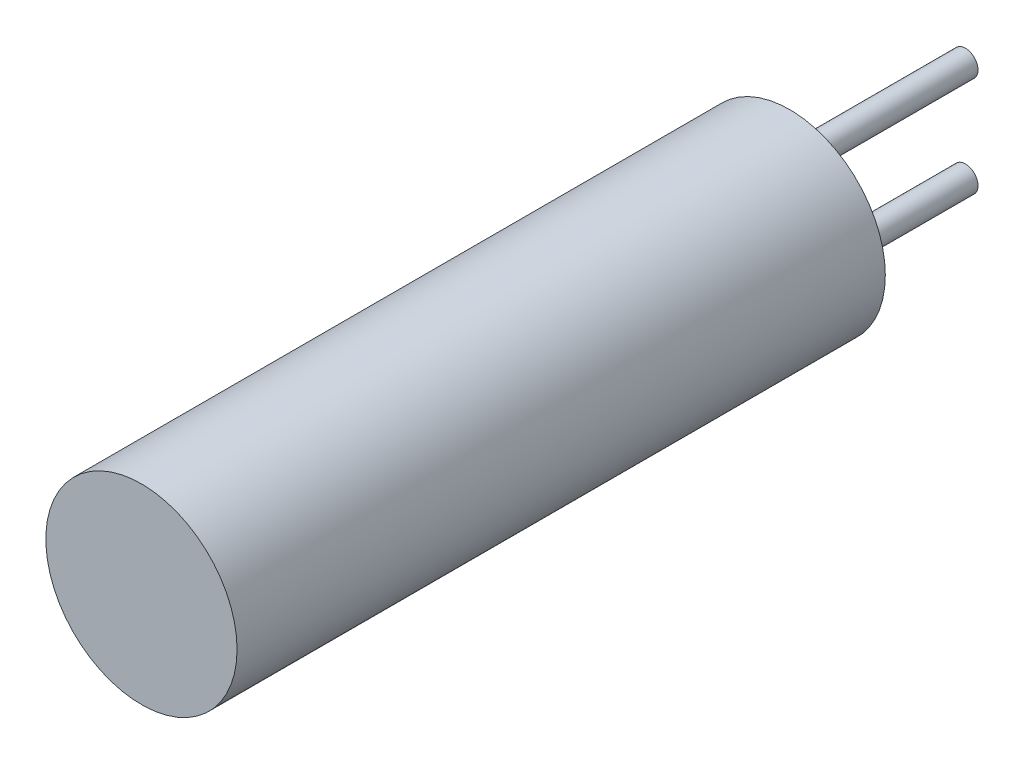
ISO-10303-21;
HEADER;
FILE_DESCRIPTION(('STEP AP214'),'2;1');
FILE_NAME('part.step','',(''),(''),'','','');
FILE_SCHEMA(('AUTOMOTIVE_DESIGN { 1 0 10303 214 1 1 1 1 }'));
ENDSEC;
DATA;
#1=APPLICATION_CONTEXT('core data for automotive mechanical design processes');
#2=APPLICATION_PROTOCOL_DEFINITION('international standard','automotive_design',2000,#1);
#3=PRODUCT_CONTEXT('',#1,'mechanical');
#4=PRODUCT('Part','Part','',(#3));
#5=PRODUCT_RELATED_PRODUCT_CATEGORY('part','',(#4));
#6=PRODUCT_DEFINITION_FORMATION('','',#4);
#7=PRODUCT_DEFINITION_CONTEXT('part definition',#1,'design');
#8=PRODUCT_DEFINITION('design','',#6,#7);
#9=PRODUCT_DEFINITION_SHAPE('','',#8);
#10=(LENGTH_UNIT() NAMED_UNIT(*) SI_UNIT(.MILLI.,.METRE.));
#11=(NAMED_UNIT(*) PLANE_ANGLE_UNIT() SI_UNIT($,.RADIAN.));
#12=(NAMED_UNIT(*) SI_UNIT($,.STERADIAN.) SOLID_ANGLE_UNIT());
#13=UNCERTAINTY_MEASURE_WITH_UNIT(LENGTH_MEASURE(1.E-05),#10,'distance_accuracy_value','');
#14=(GEOMETRIC_REPRESENTATION_CONTEXT(3) GLOBAL_UNCERTAINTY_ASSIGNED_CONTEXT((#13)) GLOBAL_UNIT_ASSIGNED_CONTEXT((#10,
#11,#12)) REPRESENTATION_CONTEXT('',''));
#15=CARTESIAN_POINT('',(0.,0.,0.));
#16=DIRECTION('',(0.,0.,1.));
#17=DIRECTION('',(1.,0.,0.));
#18=AXIS2_PLACEMENT_3D('',#15,#16,#17);
#19=CARTESIAN_POINT('',(0.,0.,-5.42));
#20=DIRECTION('',(0.,0.,-1.));
#21=DIRECTION('',(-1.,0.,0.));
#22=AXIS2_PLACEMENT_3D('',#19,#20,#21);
#23=PLANE('',#22);
#24=CARTESIAN_POINT('',(0.,1.489822979376,-5.42));
#25=DIRECTION('',(0.,0.,-1.));
#26=DIRECTION('',(-1.,0.,0.));
#27=AXIS2_PLACEMENT_3D('',#24,#25,#26);
#28=CIRCLE('',#27,0.3898185985847);
#29=CARTESIAN_POINT('',(-0.3898185985847,1.489822979376,-5.42));
#30=VERTEX_POINT('',#29);
#31=EDGE_CURVE('E17',#30,#30,#28,.F.);
#32=ORIENTED_EDGE('',*,*,#31,.F.);
#33=EDGE_LOOP('',(#32));
#34=FACE_BOUND('',#33,.T.);
#35=ADVANCED_FACE('F14',(#34),#23,.T.);
#36=CARTESIAN_POINT('',(0.,0.,-5.42));
#37=DIRECTION('',(0.,0.,-1.));
#38=DIRECTION('',(-1.,0.,0.));
#39=AXIS2_PLACEMENT_3D('',#36,#37,#38);
#40=PLANE('',#39);
#41=CARTESIAN_POINT('',(0.,-1.602262449517,-5.42));
#42=DIRECTION('',(0.,0.,-1.));
#43=DIRECTION('',(-1.,0.,0.));
#44=AXIS2_PLACEMENT_3D('',#41,#42,#43);
#45=CIRCLE('',#44,0.3898185985847);
#46=CARTESIAN_POINT('',(-0.3898185985847,-1.602262449517,-5.42));
#47=VERTEX_POINT('',#46);
#48=EDGE_CURVE('E33',#47,#47,#45,.F.);
#49=ORIENTED_EDGE('',*,*,#48,.F.);
#50=EDGE_LOOP('',(#49));
#51=FACE_BOUND('',#50,.T.);
#52=ADVANCED_FACE('F44',(#51),#40,.T.);
#53=CARTESIAN_POINT('',(0.,1.489822979376,0.));
#54=DIRECTION('',(0.,0.,-1.));
#55=DIRECTION('',(-1.,0.,0.));
#56=AXIS2_PLACEMENT_3D('',#53,#54,#55);
#57=CYLINDRICAL_SURFACE('',#56,0.3898185985847);
#58=ORIENTED_EDGE('',*,*,#31,.T.);
#59=EDGE_LOOP('',(#58));
#60=FACE_BOUND('',#59,.T.);
#61=CARTESIAN_POINT('',(0.,1.489822979376,0.));
#62=DIRECTION('',(0.,0.,-1.));
#63=DIRECTION('',(-1.,0.,0.));
#64=AXIS2_PLACEMENT_3D('',#61,#62,#63);
#65=CIRCLE('',#64,0.3898185985847);
#66=CARTESIAN_POINT('',(-0.3898185985847,1.489822979376,0.));
#67=VERTEX_POINT('',#66);
#68=EDGE_CURVE('E31',#67,#67,#65,.T.);
#69=ORIENTED_EDGE('',*,*,#68,.T.);
#70=EDGE_LOOP('',(#69));
#71=FACE_BOUND('',#70,.T.);
#72=ADVANCED_FACE('F40',(#60,#71),#57,.T.);
#73=CARTESIAN_POINT('',(0.,-1.602262449517,0.));
#74=DIRECTION('',(0.,0.,-1.));
#75=DIRECTION('',(-1.,0.,0.));
#76=AXIS2_PLACEMENT_3D('',#73,#74,#75);
#77=CYLINDRICAL_SURFACE('',#76,0.3898185985847);
#78=ORIENTED_EDGE('',*,*,#48,.T.);
#79=EDGE_LOOP('',(#78));
#80=FACE_BOUND('',#79,.T.);
#81=CARTESIAN_POINT('',(0.,-1.602262449517,0.));
#82=DIRECTION('',(0.,0.,-1.));
#83=DIRECTION('',(-1.,0.,0.));
#84=AXIS2_PLACEMENT_3D('',#81,#82,#83);
#85=CIRCLE('',#84,0.3898185985847);
#86=CARTESIAN_POINT('',(-0.3898185985847,-1.602262449517,0.));
#87=VERTEX_POINT('',#86);
#88=EDGE_CURVE('E26',#87,#87,#85,.T.);
#89=ORIENTED_EDGE('',*,*,#88,.T.);
#90=EDGE_LOOP('',(#89));
#91=FACE_BOUND('',#90,.T.);
#92=ADVANCED_FACE('F64',(#80,#91),#77,.T.);
#93=CARTESIAN_POINT('',(0.,0.,20.));
#94=DIRECTION('',(0.,0.,1.));
#95=DIRECTION('',(1.,0.,0.));
#96=AXIS2_PLACEMENT_3D('',#93,#94,#95);
#97=PLANE('',#96);
#98=CARTESIAN_POINT('',(0.,0.,20.));
#99=DIRECTION('',(0.,0.,1.));
#100=DIRECTION('',(1.,0.,0.));
#101=AXIS2_PLACEMENT_3D('',#98,#99,#100);
#102=CIRCLE('',#101,2.95);
#103=CARTESIAN_POINT('',(2.95,0.,20.));
#104=VERTEX_POINT('',#103);
#105=EDGE_CURVE('E21',#104,#104,#102,.F.);
#106=ORIENTED_EDGE('',*,*,#105,.F.);
#107=EDGE_LOOP('',(#106));
#108=FACE_BOUND('',#107,.T.);
#109=ADVANCED_FACE('F58',(#108),#97,.T.);
#110=CARTESIAN_POINT('',(0.,0.,0.));
#111=DIRECTION('',(0.,0.,1.));
#112=DIRECTION('',(1.,0.,0.));
#113=AXIS2_PLACEMENT_3D('',#110,#111,#112);
#114=PLANE('',#113);
#115=ORIENTED_EDGE('',*,*,#88,.F.);
#116=EDGE_LOOP('',(#115));
#117=FACE_BOUND('',#116,.T.);
#118=ORIENTED_EDGE('',*,*,#68,.F.);
#119=EDGE_LOOP('',(#118));
#120=FACE_BOUND('',#119,.T.);
#121=CARTESIAN_POINT('',(0.,0.,0.));
#122=DIRECTION('',(0.,0.,1.));
#123=DIRECTION('',(1.,0.,0.));
#124=AXIS2_PLACEMENT_3D('',#121,#122,#123);
#125=CIRCLE('',#124,2.95);
#126=CARTESIAN_POINT('',(2.95,0.,0.));
#127=VERTEX_POINT('',#126);
#128=EDGE_CURVE('E10',#127,#127,#125,.T.);
#129=ORIENTED_EDGE('',*,*,#128,.F.);
#130=EDGE_LOOP('',(#129));
#131=FACE_BOUND('',#130,.T.);
#132=ADVANCED_FACE('F52',(#117,#120,#131),#114,.F.);
#133=CARTESIAN_POINT('',(0.,0.,0.));
#134=DIRECTION('',(0.,0.,1.));
#135=DIRECTION('',(1.,0.,0.));
#136=AXIS2_PLACEMENT_3D('',#133,#134,#135);
#137=CYLINDRICAL_SURFACE('',#136,2.95);
#138=ORIENTED_EDGE('',*,*,#105,.T.);
#139=EDGE_LOOP('',(#138));
#140=FACE_BOUND('',#139,.T.);
#141=ORIENTED_EDGE('',*,*,#128,.T.);
#142=EDGE_LOOP('',(#141));
#143=FACE_BOUND('',#142,.T.);
#144=ADVANCED_FACE('F50',(#140,#143),#137,.T.);
#145=CLOSED_SHELL('',(#35,#52,#72,#92,#109,#132,#144));
#146=MANIFOLD_SOLID_BREP('B1',#145);
#147=ADVANCED_BREP_SHAPE_REPRESENTATION('',(#18,#146),#14);
#148=SHAPE_DEFINITION_REPRESENTATION(#9,#147);
ENDSEC;
END-ISO-10303-21;
